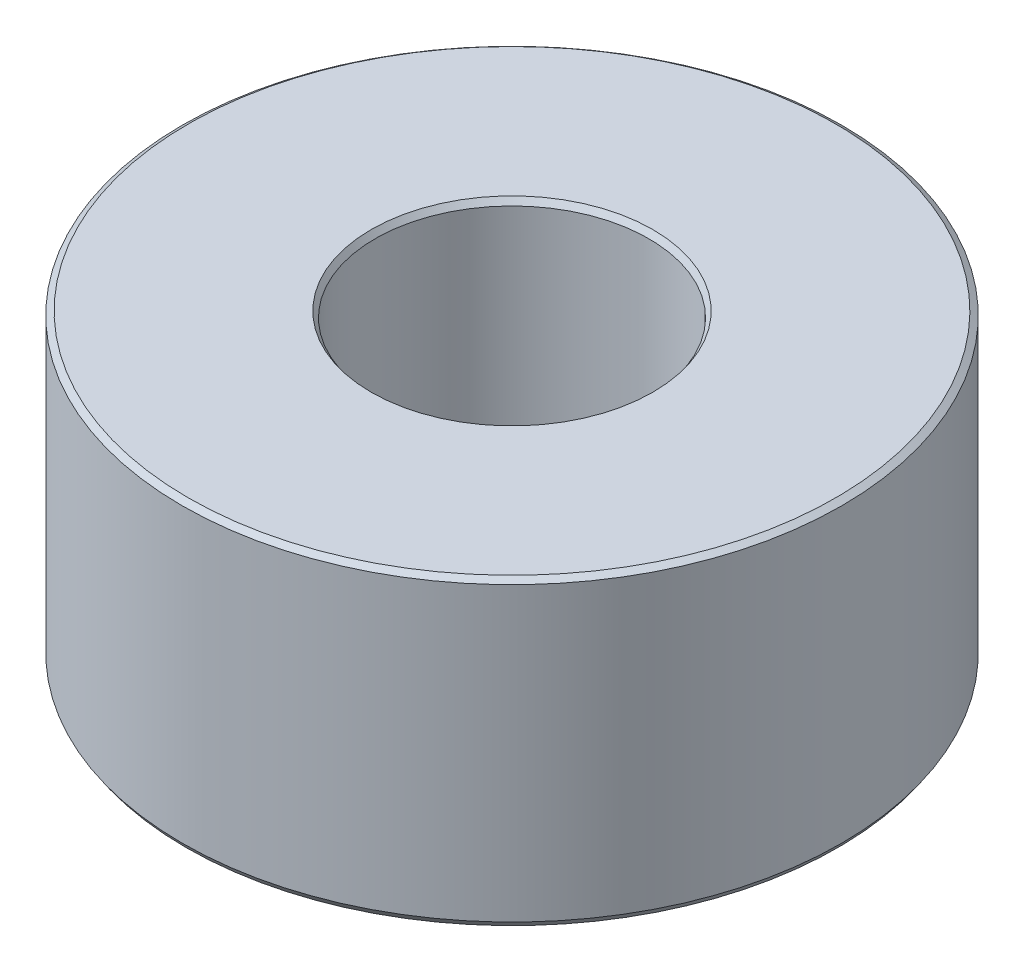
ISO-10303-21;
HEADER;
FILE_DESCRIPTION(('STEP AP214'),'2;1');
FILE_NAME('part.step','',(''),(''),'','','');
FILE_SCHEMA(('AUTOMOTIVE_DESIGN { 1 0 10303 214 1 1 1 1 }'));
ENDSEC;
DATA;
#1=APPLICATION_CONTEXT('core data for automotive mechanical design processes');
#2=APPLICATION_PROTOCOL_DEFINITION('international standard','automotive_design',2000,#1);
#3=PRODUCT_CONTEXT('',#1,'mechanical');
#4=PRODUCT('Part','Part','',(#3));
#5=PRODUCT_RELATED_PRODUCT_CATEGORY('part','',(#4));
#6=PRODUCT_DEFINITION_FORMATION('','',#4);
#7=PRODUCT_DEFINITION_CONTEXT('part definition',#1,'design');
#8=PRODUCT_DEFINITION('design','',#6,#7);
#9=PRODUCT_DEFINITION_SHAPE('','',#8);
#10=(LENGTH_UNIT() NAMED_UNIT(*) SI_UNIT(.MILLI.,.METRE.));
#11=(NAMED_UNIT(*) PLANE_ANGLE_UNIT() SI_UNIT($,.RADIAN.));
#12=(NAMED_UNIT(*) SI_UNIT($,.STERADIAN.) SOLID_ANGLE_UNIT());
#13=UNCERTAINTY_MEASURE_WITH_UNIT(LENGTH_MEASURE(1.E-05),#10,'distance_accuracy_value','');
#14=(GEOMETRIC_REPRESENTATION_CONTEXT(3) GLOBAL_UNCERTAINTY_ASSIGNED_CONTEXT((#13)) GLOBAL_UNIT_ASSIGNED_CONTEXT((#10,
#11,#12)) REPRESENTATION_CONTEXT('',''));
#15=CARTESIAN_POINT('',(0.,0.,0.));
#16=DIRECTION('',(0.,0.,1.));
#17=DIRECTION('',(1.,0.,0.));
#18=AXIS2_PLACEMENT_3D('',#15,#16,#17);
#19=CARTESIAN_POINT('',(0.,54.9735013125375,0.));
#20=DIRECTION('',(0.,-1.,0.));
#21=DIRECTION('',(0.,0.,-1.));
#22=AXIS2_PLACEMENT_3D('',#19,#20,#21);
#23=CYLINDRICAL_SURFACE('',#22,60.);
#24=CARTESIAN_POINT('',(0.,1.07573486159906,0.));
#25=DIRECTION('',(0.,1.,0.));
#26=DIRECTION('',(0.,0.,1.));
#27=AXIS2_PLACEMENT_3D('',#24,#25,#26);
#28=CIRCLE('',#27,60.);
#29=CARTESIAN_POINT('',(0.,1.07573486159906,60.));
#30=VERTEX_POINT('',#29);
#31=EDGE_CURVE('E10',#30,#30,#28,.T.);
#32=ORIENTED_EDGE('',*,*,#31,.T.);
#33=EDGE_LOOP('',(#32));
#34=FACE_BOUND('',#33,.T.);
#35=CARTESIAN_POINT('',(0.,54.2492982295097,0.));
#36=DIRECTION('',(0.,1.,0.));
#37=DIRECTION('',(0.,0.,1.));
#38=AXIS2_PLACEMENT_3D('',#35,#36,#37);
#39=CIRCLE('',#38,60.);
#40=CARTESIAN_POINT('',(0.,54.2492982295097,60.));
#41=VERTEX_POINT('',#40);
#42=EDGE_CURVE('E50',#41,#41,#39,.F.);
#43=ORIENTED_EDGE('',*,*,#42,.T.);
#44=EDGE_LOOP('',(#43));
#45=FACE_BOUND('',#44,.T.);
#46=ADVANCED_FACE('F39',(#34,#45),#23,.T.);
#47=CARTESIAN_POINT('',(0.,54.9735013125375,0.));
#48=DIRECTION('',(0.,1.,0.));
#49=DIRECTION('',(0.,0.,1.));
#50=AXIS2_PLACEMENT_3D('',#47,#48,#49);
#51=PLANE('',#50);
#52=CARTESIAN_POINT('',(0.,54.9735013125375,0.));
#53=DIRECTION('',(0.,1.,0.));
#54=DIRECTION('',(0.,0.,1.));
#55=AXIS2_PLACEMENT_3D('',#52,#53,#54);
#56=CIRCLE('',#55,25.6362286989446);
#57=CARTESIAN_POINT('',(0.,54.9735013125375,25.6362286989446));
#58=VERTEX_POINT('',#57);
#59=EDGE_CURVE('E58',#58,#58,#56,.F.);
#60=ORIENTED_EDGE('',*,*,#59,.T.);
#61=EDGE_LOOP('',(#60));
#62=FACE_BOUND('',#61,.T.);
#63=CARTESIAN_POINT('',(0.,54.9735013125375,0.));
#64=DIRECTION('',(0.,1.,0.));
#65=DIRECTION('',(0.,0.,1.));
#66=AXIS2_PLACEMENT_3D('',#63,#64,#65);
#67=CIRCLE('',#66,58.9242651384009);
#68=CARTESIAN_POINT('',(0.,54.9735013125375,58.9242651384009));
#69=VERTEX_POINT('',#68);
#70=EDGE_CURVE('E61',#69,#69,#67,.T.);
#71=ORIENTED_EDGE('',*,*,#70,.T.);
#72=EDGE_LOOP('',(#71));
#73=FACE_BOUND('',#72,.T.);
#74=ADVANCED_FACE('F88',(#62,#73),#51,.T.);
#75=CARTESIAN_POINT('',(0.,0.,0.));
#76=DIRECTION('',(0.,1.,0.));
#77=DIRECTION('',(0.,0.,1.));
#78=AXIS2_PLACEMENT_3D('',#75,#76,#77);
#79=PLANE('',#78);
#80=CARTESIAN_POINT('',(0.,0.,0.));
#81=DIRECTION('',(0.,1.,0.));
#82=DIRECTION('',(0.,0.,1.));
#83=AXIS2_PLACEMENT_3D('',#80,#81,#82);
#84=CIRCLE('',#83,25.9877604775158);
#85=CARTESIAN_POINT('',(0.,0.,25.9877604775158));
#86=VERTEX_POINT('',#85);
#87=EDGE_CURVE('E51',#86,#86,#84,.T.);
#88=ORIENTED_EDGE('',*,*,#87,.T.);
#89=EDGE_LOOP('',(#88));
#90=FACE_BOUND('',#89,.T.);
#91=CARTESIAN_POINT('',(0.,0.,0.));
#92=DIRECTION('',(0.,1.,0.));
#93=DIRECTION('',(0.,0.,1.));
#94=AXIS2_PLACEMENT_3D('',#91,#92,#93);
#95=CIRCLE('',#94,59.2757969169722);
#96=CARTESIAN_POINT('',(0.,0.,59.2757969169722));
#97=VERTEX_POINT('',#96);
#98=EDGE_CURVE('E54',#97,#97,#95,.F.);
#99=ORIENTED_EDGE('',*,*,#98,.T.);
#100=EDGE_LOOP('',(#99));
#101=FACE_BOUND('',#100,.T.);
#102=ADVANCED_FACE('F83',(#90,#101),#79,.F.);
#103=CARTESIAN_POINT('',(0.,54.9735013125375,0.));
#104=DIRECTION('',(0.,-1.,0.));
#105=DIRECTION('',(0.,0.,-1.));
#106=AXIS2_PLACEMENT_3D('',#103,#104,#105);
#107=CYLINDRICAL_SURFACE('',#106,24.9120256159168);
#108=CARTESIAN_POINT('',(0.,53.8977664509384,0.));
#109=DIRECTION('',(0.,1.,0.));
#110=DIRECTION('',(0.,0.,1.));
#111=AXIS2_PLACEMENT_3D('',#108,#109,#110);
#112=CIRCLE('',#111,24.9120256159168);
#113=CARTESIAN_POINT('',(0.,53.8977664509384,24.9120256159168));
#114=VERTEX_POINT('',#113);
#115=EDGE_CURVE('E67',#114,#114,#112,.T.);
#116=ORIENTED_EDGE('',*,*,#115,.T.);
#117=EDGE_LOOP('',(#116));
#118=FACE_BOUND('',#117,.T.);
#119=CARTESIAN_POINT('',(0.,0.724203083027807,0.));
#120=DIRECTION('',(0.,1.,0.));
#121=DIRECTION('',(0.,0.,1.));
#122=AXIS2_PLACEMENT_3D('',#119,#120,#121);
#123=CIRCLE('',#122,24.9120256159168);
#124=CARTESIAN_POINT('',(0.,0.724203083027807,24.9120256159168));
#125=VERTEX_POINT('',#124);
#126=EDGE_CURVE('E69',#125,#125,#123,.F.);
#127=ORIENTED_EDGE('',*,*,#126,.T.);
#128=EDGE_LOOP('',(#127));
#129=FACE_BOUND('',#128,.T.);
#130=ADVANCED_FACE('F71',(#118,#129),#107,.F.);
#131=CARTESIAN_POINT('',(0.,53.8977664509384,0.));
#132=DIRECTION('',(0.,1.,0.));
#133=DIRECTION('',(0.,0.,1.));
#134=AXIS2_PLACEMENT_3D('',#131,#132,#133);
#135=CONICAL_SURFACE('',#134,24.9120256159168,0.592523805797277);
#136=ORIENTED_EDGE('',*,*,#59,.F.);
#137=EDGE_LOOP('',(#136));
#138=FACE_BOUND('',#137,.T.);
#139=ORIENTED_EDGE('',*,*,#115,.F.);
#140=EDGE_LOOP('',(#139));
#141=FACE_BOUND('',#140,.T.);
#142=ADVANCED_FACE('F77',(#138,#141),#135,.F.);
#143=CARTESIAN_POINT('',(0.,0.,0.));
#144=DIRECTION('',(0.,-1.,0.));
#145=DIRECTION('',(0.,0.,-1.));
#146=AXIS2_PLACEMENT_3D('',#143,#144,#145);
#147=CONICAL_SURFACE('',#146,25.9877604775158,0.978272520997613);
#148=ORIENTED_EDGE('',*,*,#126,.F.);
#149=EDGE_LOOP('',(#148));
#150=FACE_BOUND('',#149,.T.);
#151=ORIENTED_EDGE('',*,*,#87,.F.);
#152=EDGE_LOOP('',(#151));
#153=FACE_BOUND('',#152,.T.);
#154=ADVANCED_FACE('F73',(#150,#153),#147,.F.);
#155=CARTESIAN_POINT('',(0.,1.07573486159906,0.));
#156=DIRECTION('',(0.,1.,0.));
#157=DIRECTION('',(0.,0.,1.));
#158=AXIS2_PLACEMENT_3D('',#155,#156,#157);
#159=CONICAL_SURFACE('',#158,60.,0.592523805797288);
#160=ORIENTED_EDGE('',*,*,#98,.F.);
#161=EDGE_LOOP('',(#160));
#162=FACE_BOUND('',#161,.T.);
#163=ORIENTED_EDGE('',*,*,#31,.F.);
#164=EDGE_LOOP('',(#163));
#165=FACE_BOUND('',#164,.T.);
#166=ADVANCED_FACE('F76',(#162,#165),#159,.T.);
#167=CARTESIAN_POINT('',(0.,54.9735013125375,0.));
#168=DIRECTION('',(0.,-1.,0.));
#169=DIRECTION('',(0.,0.,-1.));
#170=AXIS2_PLACEMENT_3D('',#167,#168,#169);
#171=CONICAL_SURFACE('',#170,58.9242651384009,0.978272520997619);
#172=ORIENTED_EDGE('',*,*,#42,.F.);
#173=EDGE_LOOP('',(#172));
#174=FACE_BOUND('',#173,.T.);
#175=ORIENTED_EDGE('',*,*,#70,.F.);
#176=EDGE_LOOP('',(#175));
#177=FACE_BOUND('',#176,.T.);
#178=ADVANCED_FACE('F45',(#174,#177),#171,.T.);
#179=CLOSED_SHELL('',(#46,#74,#102,#130,#142,#154,#166,#178));
#180=MANIFOLD_SOLID_BREP('B2',#179);
#181=ADVANCED_BREP_SHAPE_REPRESENTATION('',(#18,#180),#14);
#182=SHAPE_DEFINITION_REPRESENTATION(#9,#181);
ENDSEC;
END-ISO-10303-21;
